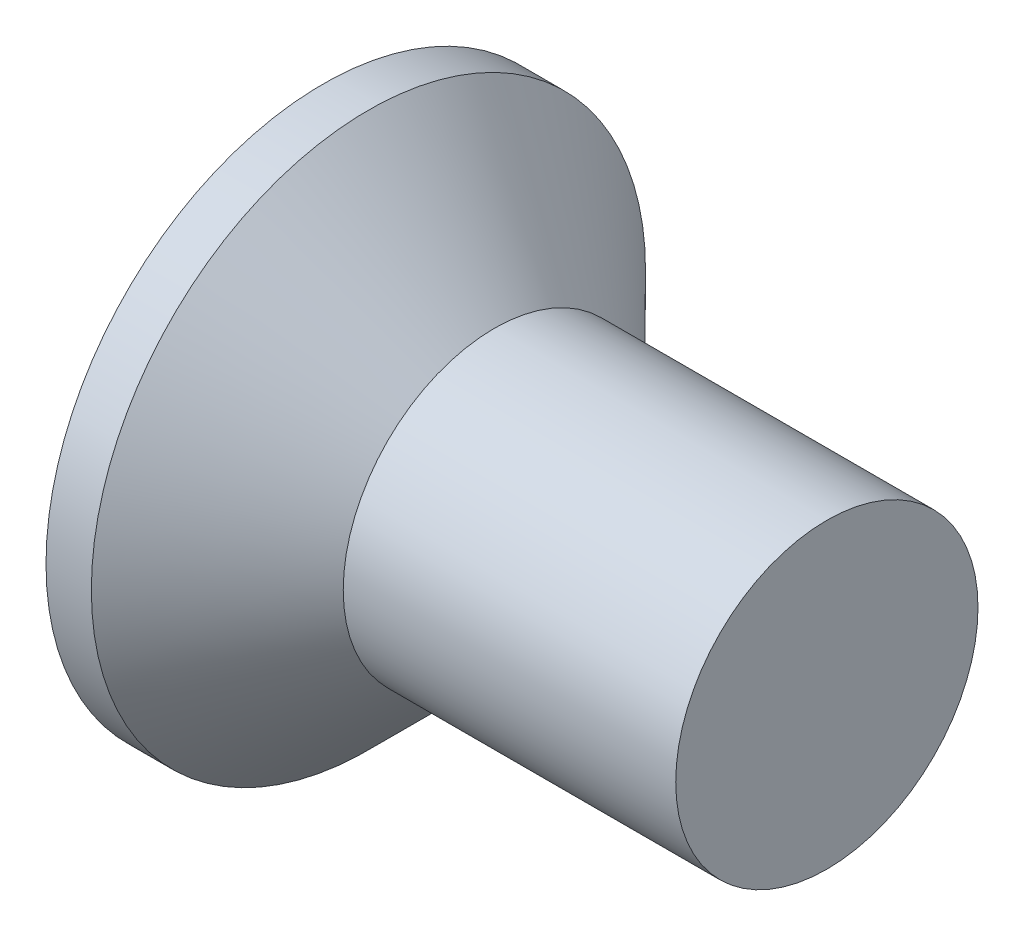
ISO-10303-21;
HEADER;
FILE_DESCRIPTION(('STEP AP214'),'2;1');
FILE_NAME('part.step','',(''),(''),'','','');
FILE_SCHEMA(('AUTOMOTIVE_DESIGN { 1 0 10303 214 1 1 1 1 }'));
ENDSEC;
DATA;
#1=APPLICATION_CONTEXT('core data for automotive mechanical design processes');
#2=APPLICATION_PROTOCOL_DEFINITION('international standard','automotive_design',2000,#1);
#3=PRODUCT_CONTEXT('',#1,'mechanical');
#4=PRODUCT('Part','Part','',(#3));
#5=PRODUCT_RELATED_PRODUCT_CATEGORY('part','',(#4));
#6=PRODUCT_DEFINITION_FORMATION('','',#4);
#7=PRODUCT_DEFINITION_CONTEXT('part definition',#1,'design');
#8=PRODUCT_DEFINITION('design','',#6,#7);
#9=PRODUCT_DEFINITION_SHAPE('','',#8);
#10=(LENGTH_UNIT() NAMED_UNIT(*) SI_UNIT(.MILLI.,.METRE.));
#11=(NAMED_UNIT(*) PLANE_ANGLE_UNIT() SI_UNIT($,.RADIAN.));
#12=(NAMED_UNIT(*) SI_UNIT($,.STERADIAN.) SOLID_ANGLE_UNIT());
#13=UNCERTAINTY_MEASURE_WITH_UNIT(LENGTH_MEASURE(1.E-05),#10,'distance_accuracy_value','');
#14=(GEOMETRIC_REPRESENTATION_CONTEXT(3) GLOBAL_UNCERTAINTY_ASSIGNED_CONTEXT((#13)) GLOBAL_UNIT_ASSIGNED_CONTEXT((#10,
#11,#12)) REPRESENTATION_CONTEXT('',''));
#15=CARTESIAN_POINT('',(0.,0.,0.));
#16=DIRECTION('',(0.,0.,1.));
#17=DIRECTION('',(1.,0.,0.));
#18=AXIS2_PLACEMENT_3D('',#15,#16,#17);
#19=CARTESIAN_POINT('',(0.,0.,0.));
#20=DIRECTION('',(-1.,0.,0.));
#21=DIRECTION('',(0.,0.,1.));
#22=AXIS2_PLACEMENT_3D('',#19,#20,#21);
#23=PLANE('',#22);
#24=CARTESIAN_POINT('',(0.,0.,0.));
#25=DIRECTION('',(-1.,0.,0.));
#26=DIRECTION('',(0.,0.,1.));
#27=AXIS2_PLACEMENT_3D('',#24,#25,#26);
#28=CIRCLE('',#27,2.75);
#29=CARTESIAN_POINT('',(0.,0.,2.75));
#30=VERTEX_POINT('',#29);
#31=EDGE_CURVE('E125',#30,#30,#28,.T.);
#32=ORIENTED_EDGE('',*,*,#31,.T.);
#33=EDGE_LOOP('',(#32));
#34=FACE_BOUND('',#33,.T.);
#35=DIRECTION('',(0.,1.,0.));
#36=VECTOR('',#35,1.);
#37=CARTESIAN_POINT('',(0.,-1.55,-0.395));
#38=LINE('',#37,#36);
#39=CARTESIAN_POINT('',(0.,-1.55,-0.395));
#40=VERTEX_POINT('',#39);
#41=CARTESIAN_POINT('',(0.,-0.394999999999999,-0.395));
#42=VERTEX_POINT('',#41);
#43=EDGE_CURVE('E100',#40,#42,#38,.T.);
#44=ORIENTED_EDGE('',*,*,#43,.T.);
#45=DIRECTION('',(0.,0.,-1.));
#46=VECTOR('',#45,1.);
#47=CARTESIAN_POINT('',(0.,-0.395000000000005,1.55));
#48=LINE('',#47,#46);
#49=CARTESIAN_POINT('',(0.,-0.394999999999995,-1.55));
#50=VERTEX_POINT('',#49);
#51=EDGE_CURVE('E80',#42,#50,#48,.T.);
#52=ORIENTED_EDGE('',*,*,#51,.T.);
#53=DIRECTION('',(0.,1.,0.));
#54=VECTOR('',#53,1.);
#55=CARTESIAN_POINT('',(0.,-0.394999999999995,-1.55));
#56=LINE('',#55,#54);
#57=CARTESIAN_POINT('',(0.,0.395000000000005,-1.55));
#58=VERTEX_POINT('',#57);
#59=EDGE_CURVE('E323',#50,#58,#56,.T.);
#60=ORIENTED_EDGE('',*,*,#59,.T.);
#61=DIRECTION('',(0.,0.,1.));
#62=VECTOR('',#61,1.);
#63=CARTESIAN_POINT('',(0.,0.395000000000005,-1.55));
#64=LINE('',#63,#62);
#65=CARTESIAN_POINT('',(0.,0.395000000000001,-0.395));
#66=VERTEX_POINT('',#65);
#67=EDGE_CURVE('E96',#58,#66,#64,.T.);
#68=ORIENTED_EDGE('',*,*,#67,.T.);
#69=CARTESIAN_POINT('',(0.,1.55,-0.395));
#70=VERTEX_POINT('',#69);
#71=EDGE_CURVE('E90',#66,#70,#38,.T.);
#72=ORIENTED_EDGE('',*,*,#71,.T.);
#73=DIRECTION('',(0.,0.,1.));
#74=VECTOR('',#73,1.);
#75=CARTESIAN_POINT('',(0.,1.55,-0.395));
#76=LINE('',#75,#74);
#77=CARTESIAN_POINT('',(0.,1.55,0.395));
#78=VERTEX_POINT('',#77);
#79=EDGE_CURVE('E93',#70,#78,#76,.T.);
#80=ORIENTED_EDGE('',*,*,#79,.T.);
#81=DIRECTION('',(0.,-1.,0.));
#82=VECTOR('',#81,1.);
#83=CARTESIAN_POINT('',(0.,1.55,0.395));
#84=LINE('',#83,#82);
#85=CARTESIAN_POINT('',(0.,0.394999999999998,0.395));
#86=VERTEX_POINT('',#85);
#87=EDGE_CURVE('E315',#78,#86,#84,.T.);
#88=ORIENTED_EDGE('',*,*,#87,.T.);
#89=CARTESIAN_POINT('',(0.,0.394999999999994,1.55));
#90=VERTEX_POINT('',#89);
#91=EDGE_CURVE('E333',#86,#90,#64,.T.);
#92=ORIENTED_EDGE('',*,*,#91,.T.);
#93=DIRECTION('',(0.,-1.,0.));
#94=VECTOR('',#93,1.);
#95=CARTESIAN_POINT('',(0.,0.394999999999994,1.55));
#96=LINE('',#95,#94);
#97=CARTESIAN_POINT('',(0.,-0.395000000000005,1.55));
#98=VERTEX_POINT('',#97);
#99=EDGE_CURVE('E335',#90,#98,#96,.T.);
#100=ORIENTED_EDGE('',*,*,#99,.T.);
#101=CARTESIAN_POINT('',(0.,-0.395000000000001,0.395));
#102=VERTEX_POINT('',#101);
#103=EDGE_CURVE('E337',#98,#102,#48,.T.);
#104=ORIENTED_EDGE('',*,*,#103,.T.);
#105=CARTESIAN_POINT('',(0.,-1.55,0.395));
#106=VERTEX_POINT('',#105);
#107=EDGE_CURVE('E106',#102,#106,#84,.T.);
#108=ORIENTED_EDGE('',*,*,#107,.T.);
#109=DIRECTION('',(0.,0.,-1.));
#110=VECTOR('',#109,1.);
#111=CARTESIAN_POINT('',(0.,-1.55,0.395));
#112=LINE('',#111,#110);
#113=EDGE_CURVE('E129',#106,#40,#112,.T.);
#114=ORIENTED_EDGE('',*,*,#113,.T.);
#115=EDGE_LOOP('',(#44,#52,#60,#68,#72,#80,#88,#92,#100,#104,#108,#114));
#116=FACE_BOUND('',#115,.T.);
#117=ADVANCED_FACE('F31',(#34,#116),#23,.T.);
#118=CARTESIAN_POINT('',(2.38373382624769,0.,0.16865988909427));
#119=DIRECTION('',(-0.0945267588569115,0.,-0.995522321125954));
#120=DIRECTION('',(-0.995522321125954,0.,0.0945267588569115));
#121=AXIS2_PLACEMENT_3D('',#118,#119,#120);
#122=PLANE('',#121);
#123=ORIENTED_EDGE('',*,*,#107,.F.);
#124=DIRECTION('',(0.991104257398676,0.0941072552097304,-0.0941072552097301));
#125=VECTOR('',#124,1.);
#126=CARTESIAN_POINT('',(2.39946475118715,-0.16716620751949,0.167166207519489));
#127=LINE('',#126,#125);
#128=CARTESIAN_POINT('',(2.08,-0.197500000000001,0.197499999999999));
#129=VERTEX_POINT('',#128);
#130=EDGE_CURVE('E124',#102,#129,#127,.T.);
#131=ORIENTED_EDGE('',*,*,#130,.T.);
#132=DIRECTION('',(0.835707904588477,0.543411029305728,-0.0793520726712617));
#133=VECTOR('',#132,1.);
#134=CARTESIAN_POINT('',(0.,-1.55,0.395));
#135=LINE('',#134,#133);
#136=EDGE_CURVE('E101',#106,#129,#135,.T.);
#137=ORIENTED_EDGE('',*,*,#136,.F.);
#138=EDGE_LOOP('',(#123,#131,#137));
#139=FACE_BOUND('',#138,.T.);
#140=ADVANCED_FACE('F149',(#139),#122,.T.);
#141=DIRECTION('',(0.835707904588477,-0.543411029305728,-0.0793520726712616));
#142=VECTOR('',#141,1.);
#143=CARTESIAN_POINT('',(0.,1.55,0.395));
#144=LINE('',#143,#142);
#145=CARTESIAN_POINT('',(2.08,0.1975,0.1975));
#146=VERTEX_POINT('',#145);
#147=EDGE_CURVE('E46',#78,#146,#144,.T.);
#148=ORIENTED_EDGE('',*,*,#147,.T.);
#149=DIRECTION('',(-0.991104257398676,0.0941072552097296,0.0941072552097301));
#150=VECTOR('',#149,1.);
#151=CARTESIAN_POINT('',(2.39946475118715,0.167166207519489,0.167166207519489));
#152=LINE('',#151,#150);
#153=EDGE_CURVE('E319',#146,#86,#152,.T.);
#154=ORIENTED_EDGE('',*,*,#153,.T.);
#155=ORIENTED_EDGE('',*,*,#87,.F.);
#156=EDGE_LOOP('',(#148,#154,#155));
#157=FACE_BOUND('',#156,.T.);
#158=ADVANCED_FACE('F155',(#157),#122,.T.);
#159=CARTESIAN_POINT('',(2.38373382624769,0.,-0.16865988909427));
#160=DIRECTION('',(-0.0945267588569114,0.,0.995522321125954));
#161=DIRECTION('',(0.995522321125954,0.,0.0945267588569114));
#162=AXIS2_PLACEMENT_3D('',#159,#160,#161);
#163=PLANE('',#162);
#164=DIRECTION('',(0.835707904588477,0.543411029305729,0.0793520726712616));
#165=VECTOR('',#164,1.);
#166=CARTESIAN_POINT('',(0.,-1.55,-0.395));
#167=LINE('',#166,#165);
#168=CARTESIAN_POINT('',(2.08,-0.197499999999999,-0.197500000000001));
#169=VERTEX_POINT('',#168);
#170=EDGE_CURVE('E55',#40,#169,#167,.T.);
#171=ORIENTED_EDGE('',*,*,#170,.T.);
#172=DIRECTION('',(-0.991104257398676,-0.0941072552097298,-0.09410725520973));
#173=VECTOR('',#172,1.);
#174=CARTESIAN_POINT('',(2.39946475118715,-0.167166207519489,-0.167166207519489));
#175=LINE('',#174,#173);
#176=EDGE_CURVE('E11',#169,#42,#175,.T.);
#177=ORIENTED_EDGE('',*,*,#176,.T.);
#178=ORIENTED_EDGE('',*,*,#43,.F.);
#179=EDGE_LOOP('',(#171,#177,#178));
#180=FACE_BOUND('',#179,.T.);
#181=ADVANCED_FACE('F146',(#180),#163,.T.);
#182=ORIENTED_EDGE('',*,*,#71,.F.);
#183=DIRECTION('',(0.991104257398676,-0.0941072552097303,0.09410725520973));
#184=VECTOR('',#183,1.);
#185=CARTESIAN_POINT('',(2.39946475118715,0.16716620751949,-0.167166207519489));
#186=LINE('',#185,#184);
#187=CARTESIAN_POINT('',(2.08,0.1975,-0.1975));
#188=VERTEX_POINT('',#187);
#189=EDGE_CURVE('E109',#66,#188,#186,.T.);
#190=ORIENTED_EDGE('',*,*,#189,.T.);
#191=DIRECTION('',(0.835707904588477,-0.543411029305729,0.0793520726712616));
#192=VECTOR('',#191,1.);
#193=CARTESIAN_POINT('',(0.,1.55,-0.395));
#194=LINE('',#193,#192);
#195=EDGE_CURVE('E105',#70,#188,#194,.T.);
#196=ORIENTED_EDGE('',*,*,#195,.F.);
#197=EDGE_LOOP('',(#182,#190,#196));
#198=FACE_BOUND('',#197,.T.);
#199=ADVANCED_FACE('F108',(#198),#163,.T.);
#200=CARTESIAN_POINT('',(5.,1.5,0.));
#201=DIRECTION('',(1.,0.,0.));
#202=DIRECTION('',(0.,0.,-1.));
#203=AXIS2_PLACEMENT_3D('',#200,#201,#202);
#204=PLANE('',#203);
#205=CARTESIAN_POINT('',(5.,0.,0.));
#206=DIRECTION('',(-1.,0.,0.));
#207=DIRECTION('',(0.,0.,1.));
#208=AXIS2_PLACEMENT_3D('',#205,#206,#207);
#209=CIRCLE('',#208,1.5);
#210=CARTESIAN_POINT('',(5.,0.,1.5));
#211=VERTEX_POINT('',#210);
#212=EDGE_CURVE('E39',#211,#211,#209,.T.);
#213=ORIENTED_EDGE('',*,*,#212,.F.);
#214=EDGE_LOOP('',(#213));
#215=FACE_BOUND('',#214,.T.);
#216=ADVANCED_FACE('F33',(#215),#204,.T.);
#217=CARTESIAN_POINT('',(-6.34999999999999,0.,0.));
#218=DIRECTION('',(-1.,0.,0.));
#219=DIRECTION('',(0.,0.,1.));
#220=AXIS2_PLACEMENT_3D('',#217,#218,#219);
#221=CYLINDRICAL_SURFACE('',#220,1.5);
#222=ORIENTED_EDGE('',*,*,#212,.T.);
#223=EDGE_LOOP('',(#222));
#224=FACE_BOUND('',#223,.T.);
#225=CARTESIAN_POINT('',(1.7,0.,0.));
#226=DIRECTION('',(-1.,0.,0.));
#227=DIRECTION('',(0.,0.,1.));
#228=AXIS2_PLACEMENT_3D('',#225,#226,#227);
#229=CIRCLE('',#228,1.5);
#230=CARTESIAN_POINT('',(1.7,0.,1.5));
#231=VERTEX_POINT('',#230);
#232=EDGE_CURVE('E132',#231,#231,#229,.T.);
#233=ORIENTED_EDGE('',*,*,#232,.F.);
#234=EDGE_LOOP('',(#233));
#235=FACE_BOUND('',#234,.T.);
#236=ADVANCED_FACE('F137',(#224,#235),#221,.T.);
#237=CARTESIAN_POINT('',(0.450000000000004,0.,0.));
#238=DIRECTION('',(-1.,0.,0.));
#239=DIRECTION('',(0.,0.,1.));
#240=AXIS2_PLACEMENT_3D('',#237,#238,#239);
#241=CONICAL_SURFACE('',#240,2.75,0.78539816339745);
#242=ORIENTED_EDGE('',*,*,#232,.T.);
#243=EDGE_LOOP('',(#242));
#244=FACE_BOUND('',#243,.T.);
#245=CARTESIAN_POINT('',(0.450000000000004,0.,0.));
#246=DIRECTION('',(-1.,0.,0.));
#247=DIRECTION('',(0.,0.,1.));
#248=AXIS2_PLACEMENT_3D('',#245,#246,#247);
#249=CIRCLE('',#248,2.75);
#250=CARTESIAN_POINT('',(0.450000000000004,0.,2.75));
#251=VERTEX_POINT('',#250);
#252=EDGE_CURVE('E128',#251,#251,#249,.T.);
#253=ORIENTED_EDGE('',*,*,#252,.F.);
#254=EDGE_LOOP('',(#253));
#255=FACE_BOUND('',#254,.T.);
#256=ADVANCED_FACE('F145',(#244,#255),#241,.T.);
#257=CARTESIAN_POINT('',(-6.34999999999999,0.,0.));
#258=DIRECTION('',(-1.,0.,0.));
#259=DIRECTION('',(0.,0.,1.));
#260=AXIS2_PLACEMENT_3D('',#257,#258,#259);
#261=CYLINDRICAL_SURFACE('',#260,2.75);
#262=ORIENTED_EDGE('',*,*,#252,.T.);
#263=EDGE_LOOP('',(#262));
#264=FACE_BOUND('',#263,.T.);
#265=ORIENTED_EDGE('',*,*,#31,.F.);
#266=EDGE_LOOP('',(#265));
#267=FACE_BOUND('',#266,.T.);
#268=ADVANCED_FACE('F162',(#264,#267),#261,.T.);
#269=CARTESIAN_POINT('',(2.08,-0.1975,-0.1975));
#270=DIRECTION('',(-1.,0.,0.));
#271=DIRECTION('',(0.,0.,1.));
#272=AXIS2_PLACEMENT_3D('',#269,#270,#271);
#273=PLANE('',#272);
#274=DIRECTION('',(0.,1.,0.));
#275=VECTOR('',#274,1.);
#276=CARTESIAN_POINT('',(2.08,-0.1975,-0.1975));
#277=LINE('',#276,#275);
#278=EDGE_CURVE('E120',#169,#188,#277,.T.);
#279=ORIENTED_EDGE('',*,*,#278,.F.);
#280=DIRECTION('',(0.,0.,-1.));
#281=VECTOR('',#280,1.);
#282=CARTESIAN_POINT('',(2.08,-0.1975,0.1975));
#283=LINE('',#282,#281);
#284=EDGE_CURVE('E111',#129,#169,#283,.T.);
#285=ORIENTED_EDGE('',*,*,#284,.F.);
#286=DIRECTION('',(0.,-1.,0.));
#287=VECTOR('',#286,1.);
#288=CARTESIAN_POINT('',(2.08,0.1975,0.1975));
#289=LINE('',#288,#287);
#290=EDGE_CURVE('E114',#146,#129,#289,.T.);
#291=ORIENTED_EDGE('',*,*,#290,.F.);
#292=DIRECTION('',(0.,0.,1.));
#293=VECTOR('',#292,1.);
#294=CARTESIAN_POINT('',(2.08,0.1975,-0.1975));
#295=LINE('',#294,#293);
#296=EDGE_CURVE('E118',#188,#146,#295,.T.);
#297=ORIENTED_EDGE('',*,*,#296,.F.);
#298=EDGE_LOOP('',(#279,#285,#291,#297));
#299=FACE_BOUND('',#298,.T.);
#300=ADVANCED_FACE('F160',(#299),#273,.T.);
#301=CARTESIAN_POINT('',(0.,-1.55,-0.395));
#302=DIRECTION('',(-0.54513001368185,0.838351518268576,0.));
#303=DIRECTION('',(-0.838351518268576,-0.54513001368185,0.));
#304=AXIS2_PLACEMENT_3D('',#301,#302,#303);
#305=PLANE('',#304);
#306=ORIENTED_EDGE('',*,*,#170,.F.);
#307=ORIENTED_EDGE('',*,*,#113,.F.);
#308=ORIENTED_EDGE('',*,*,#136,.T.);
#309=ORIENTED_EDGE('',*,*,#284,.T.);
#310=EDGE_LOOP('',(#306,#307,#308,#309));
#311=FACE_BOUND('',#310,.T.);
#312=ADVANCED_FACE('F187',(#311),#305,.T.);
#313=CARTESIAN_POINT('',(0.,1.55,0.395));
#314=DIRECTION('',(-0.54513001368185,-0.838351518268576,0.));
#315=DIRECTION('',(0.838351518268576,-0.54513001368185,0.));
#316=AXIS2_PLACEMENT_3D('',#313,#314,#315);
#317=PLANE('',#316);
#318=ORIENTED_EDGE('',*,*,#147,.F.);
#319=ORIENTED_EDGE('',*,*,#79,.F.);
#320=ORIENTED_EDGE('',*,*,#195,.T.);
#321=ORIENTED_EDGE('',*,*,#296,.T.);
#322=EDGE_LOOP('',(#318,#319,#320,#321));
#323=FACE_BOUND('',#322,.T.);
#324=ADVANCED_FACE('F104',(#323),#317,.T.);
#325=CARTESIAN_POINT('',(2.38373382624769,-0.16865988909427,0.));
#326=DIRECTION('',(-0.0945267588569115,0.995522321125954,0.));
#327=DIRECTION('',(-0.995522321125954,-0.0945267588569115,0.));
#328=AXIS2_PLACEMENT_3D('',#325,#326,#327);
#329=PLANE('',#328);
#330=DIRECTION('',(0.835707904588477,0.0793520726712598,0.543411029305729));
#331=VECTOR('',#330,1.);
#332=CARTESIAN_POINT('',(0.,-0.394999999999995,-1.55));
#333=LINE('',#332,#331);
#334=EDGE_CURVE('E330',#50,#169,#333,.T.);
#335=ORIENTED_EDGE('',*,*,#334,.F.);
#336=ORIENTED_EDGE('',*,*,#51,.F.);
#337=ORIENTED_EDGE('',*,*,#176,.F.);
#338=EDGE_LOOP('',(#335,#336,#337));
#339=FACE_BOUND('',#338,.T.);
#340=ADVANCED_FACE('F196',(#339),#329,.T.);
#341=CARTESIAN_POINT('',(2.38373382624769,0.16865988909427,0.));
#342=DIRECTION('',(-0.0945267588569114,-0.995522321125954,0.));
#343=DIRECTION('',(0.995522321125954,-0.0945267588569114,0.));
#344=AXIS2_PLACEMENT_3D('',#341,#342,#343);
#345=PLANE('',#344);
#346=ORIENTED_EDGE('',*,*,#67,.F.);
#347=DIRECTION('',(0.835707904588477,-0.0793520726712635,0.543411029305728));
#348=VECTOR('',#347,1.);
#349=CARTESIAN_POINT('',(0.,0.395000000000005,-1.55));
#350=LINE('',#349,#348);
#351=EDGE_CURVE('E71',#58,#188,#350,.T.);
#352=ORIENTED_EDGE('',*,*,#351,.T.);
#353=ORIENTED_EDGE('',*,*,#189,.F.);
#354=EDGE_LOOP('',(#346,#352,#353));
#355=FACE_BOUND('',#354,.T.);
#356=ADVANCED_FACE('F207',(#355),#345,.T.);
#357=CARTESIAN_POINT('',(0.,0.395000000000005,-1.55));
#358=DIRECTION('',(-0.54513001368185,0.,0.838351518268576));
#359=DIRECTION('',(-0.838351518268576,0.,-0.54513001368185));
#360=AXIS2_PLACEMENT_3D('',#357,#358,#359);
#361=PLANE('',#360);
#362=ORIENTED_EDGE('',*,*,#351,.F.);
#363=ORIENTED_EDGE('',*,*,#59,.F.);
#364=ORIENTED_EDGE('',*,*,#334,.T.);
#365=ORIENTED_EDGE('',*,*,#278,.T.);
#366=EDGE_LOOP('',(#362,#363,#364,#365));
#367=FACE_BOUND('',#366,.T.);
#368=ADVANCED_FACE('F215',(#367),#361,.T.);
#369=ORIENTED_EDGE('',*,*,#103,.F.);
#370=DIRECTION('',(0.835707904588477,0.0793520726712635,-0.543411029305728));
#371=VECTOR('',#370,1.);
#372=CARTESIAN_POINT('',(0.,-0.395000000000005,1.55));
#373=LINE('',#372,#371);
#374=EDGE_CURVE('E326',#98,#129,#373,.T.);
#375=ORIENTED_EDGE('',*,*,#374,.T.);
#376=ORIENTED_EDGE('',*,*,#130,.F.);
#377=EDGE_LOOP('',(#369,#375,#376));
#378=FACE_BOUND('',#377,.T.);
#379=ADVANCED_FACE('F209',(#378),#329,.T.);
#380=DIRECTION('',(0.835707904588477,-0.0793520726712597,-0.543411029305729));
#381=VECTOR('',#380,1.);
#382=CARTESIAN_POINT('',(0.,0.394999999999994,1.55));
#383=LINE('',#382,#381);
#384=EDGE_CURVE('E324',#90,#146,#383,.T.);
#385=ORIENTED_EDGE('',*,*,#384,.F.);
#386=ORIENTED_EDGE('',*,*,#91,.F.);
#387=ORIENTED_EDGE('',*,*,#153,.F.);
#388=EDGE_LOOP('',(#385,#386,#387));
#389=FACE_BOUND('',#388,.T.);
#390=ADVANCED_FACE('F217',(#389),#345,.T.);
#391=CARTESIAN_POINT('',(0.,-0.395000000000005,1.55));
#392=DIRECTION('',(-0.54513001368185,0.,-0.838351518268576));
#393=DIRECTION('',(0.838351518268576,0.,-0.54513001368185));
#394=AXIS2_PLACEMENT_3D('',#391,#392,#393);
#395=PLANE('',#394);
#396=ORIENTED_EDGE('',*,*,#374,.F.);
#397=ORIENTED_EDGE('',*,*,#99,.F.);
#398=ORIENTED_EDGE('',*,*,#384,.T.);
#399=ORIENTED_EDGE('',*,*,#290,.T.);
#400=EDGE_LOOP('',(#396,#397,#398,#399));
#401=FACE_BOUND('',#400,.T.);
#402=ADVANCED_FACE('F236',(#401),#395,.T.);
#403=CLOSED_SHELL('',(#117,#140,#158,#181,#199,#216,#236,#256,#268,#300,#312,#324,#340,#356,
#368,#379,#390,#402));
#404=MANIFOLD_SOLID_BREP('B2',#403);
#405=ADVANCED_BREP_SHAPE_REPRESENTATION('',(#18,#404),#14);
#406=SHAPE_DEFINITION_REPRESENTATION(#9,#405);
ENDSEC;
END-ISO-10303-21;
